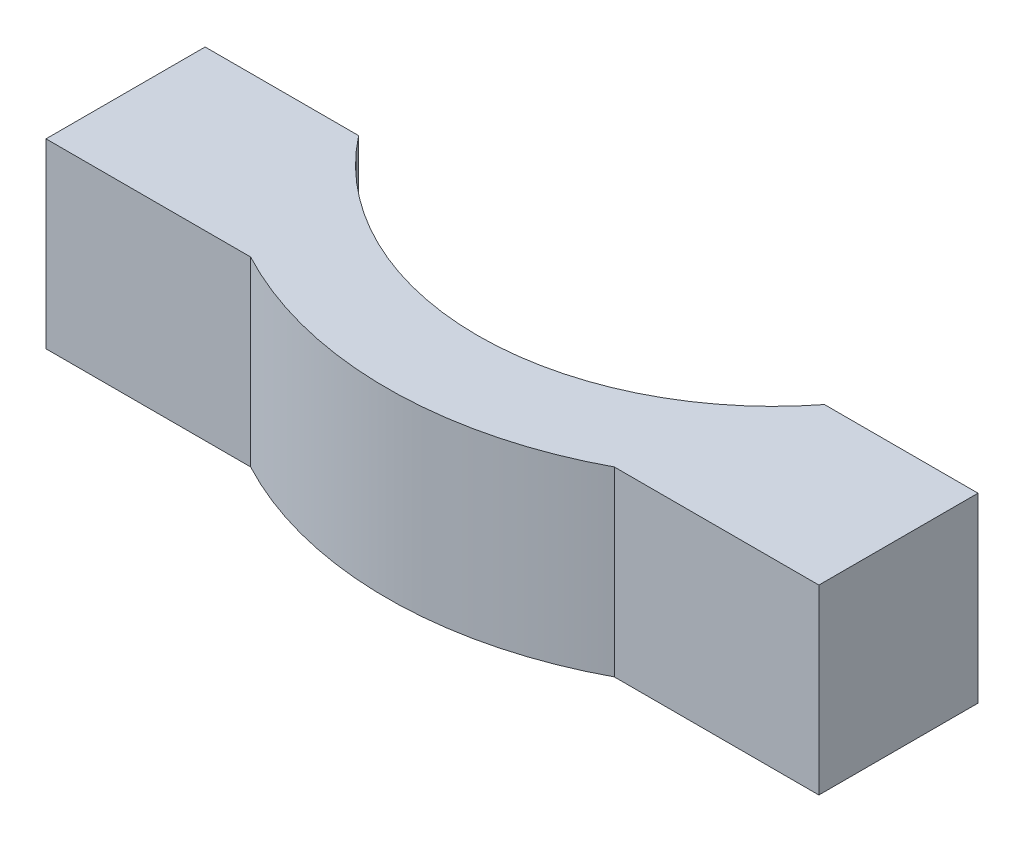
ISO-10303-21;
HEADER;
FILE_DESCRIPTION(('STEP AP214'),'2;1');
FILE_NAME('part.step','',(''),(''),'','','');
FILE_SCHEMA(('AUTOMOTIVE_DESIGN { 1 0 10303 214 1 1 1 1 }'));
ENDSEC;
DATA;
#1=APPLICATION_CONTEXT('core data for automotive mechanical design processes');
#2=APPLICATION_PROTOCOL_DEFINITION('international standard','automotive_design',2000,#1);
#3=PRODUCT_CONTEXT('',#1,'mechanical');
#4=PRODUCT('Part','Part','',(#3));
#5=PRODUCT_RELATED_PRODUCT_CATEGORY('part','',(#4));
#6=PRODUCT_DEFINITION_FORMATION('','',#4);
#7=PRODUCT_DEFINITION_CONTEXT('part definition',#1,'design');
#8=PRODUCT_DEFINITION('design','',#6,#7);
#9=PRODUCT_DEFINITION_SHAPE('','',#8);
#10=(LENGTH_UNIT() NAMED_UNIT(*) SI_UNIT(.MILLI.,.METRE.));
#11=(NAMED_UNIT(*) PLANE_ANGLE_UNIT() SI_UNIT($,.RADIAN.));
#12=(NAMED_UNIT(*) SI_UNIT($,.STERADIAN.) SOLID_ANGLE_UNIT());
#13=UNCERTAINTY_MEASURE_WITH_UNIT(LENGTH_MEASURE(1.E-05),#10,'distance_accuracy_value','');
#14=(GEOMETRIC_REPRESENTATION_CONTEXT(3) GLOBAL_UNCERTAINTY_ASSIGNED_CONTEXT((#13)) GLOBAL_UNIT_ASSIGNED_CONTEXT((#10,
#11,#12)) REPRESENTATION_CONTEXT('',''));
#15=CARTESIAN_POINT('',(0.,0.,0.));
#16=DIRECTION('',(0.,0.,1.));
#17=DIRECTION('',(1.,0.,0.));
#18=AXIS2_PLACEMENT_3D('',#15,#16,#17);
#19=CARTESIAN_POINT('',(0.,8.,0.));
#20=DIRECTION('',(0.,-1.,0.));
#21=DIRECTION('',(0.,0.,-1.));
#22=AXIS2_PLACEMENT_3D('',#19,#20,#21);
#23=CYLINDRICAL_SURFACE('',#22,17.);
#24=CARTESIAN_POINT('',(0.,8.,0.));
#25=DIRECTION('',(0.,1.,0.));
#26=DIRECTION('',(0.,0.,1.));
#27=AXIS2_PLACEMENT_3D('',#24,#25,#26);
#28=CIRCLE('',#27,17.);
#29=CARTESIAN_POINT('',(-7.99999999999978,8.,15.0000000000001));
#30=VERTEX_POINT('',#29);
#31=CARTESIAN_POINT('',(7.99999999999978,8.,15.0000000000001));
#32=VERTEX_POINT('',#31);
#33=EDGE_CURVE('E143',#30,#32,#28,.T.);
#34=ORIENTED_EDGE('',*,*,#33,.F.);
#35=DIRECTION('',(0.,-1.,0.));
#36=VECTOR('',#35,1.);
#37=CARTESIAN_POINT('',(-7.99999999999978,8.,15.0000000000001));
#38=LINE('',#37,#36);
#39=CARTESIAN_POINT('',(-7.99999999999978,0.,15.0000000000001));
#40=VERTEX_POINT('',#39);
#41=EDGE_CURVE('E139',#30,#40,#38,.T.);
#42=ORIENTED_EDGE('',*,*,#41,.T.);
#43=CARTESIAN_POINT('',(0.,0.,0.));
#44=DIRECTION('',(0.,1.,0.));
#45=DIRECTION('',(0.,0.,1.));
#46=AXIS2_PLACEMENT_3D('',#43,#44,#45);
#47=CIRCLE('',#46,17.);
#48=CARTESIAN_POINT('',(7.99999999999978,0.,15.0000000000001));
#49=VERTEX_POINT('',#48);
#50=EDGE_CURVE('E142',#40,#49,#47,.T.);
#51=ORIENTED_EDGE('',*,*,#50,.T.);
#52=DIRECTION('',(0.,-1.,0.));
#53=VECTOR('',#52,1.);
#54=CARTESIAN_POINT('',(7.99999999999978,8.,15.0000000000001));
#55=LINE('',#54,#53);
#56=EDGE_CURVE('E135',#49,#32,#55,.F.);
#57=ORIENTED_EDGE('',*,*,#56,.T.);
#58=EDGE_LOOP('',(#34,#42,#51,#57));
#59=FACE_BOUND('',#58,.T.);
#60=ADVANCED_FACE('F33',(#59),#23,.T.);
#61=CARTESIAN_POINT('',(0.,8.,0.));
#62=DIRECTION('',(0.,1.,0.));
#63=DIRECTION('',(0.,0.,1.));
#64=AXIS2_PLACEMENT_3D('',#61,#62,#63);
#65=PLANE('',#64);
#66=DIRECTION('',(1.,0.,0.));
#67=VECTOR('',#66,1.);
#68=CARTESIAN_POINT('',(-20.1033868877971,8.,8.));
#69=LINE('',#68,#67);
#70=CARTESIAN_POINT('',(-17.,8.,8.));
#71=VERTEX_POINT('',#70);
#72=CARTESIAN_POINT('',(-10.2469507659596,8.,8.));
#73=VERTEX_POINT('',#72);
#74=EDGE_CURVE('E47',#71,#73,#69,.T.);
#75=ORIENTED_EDGE('',*,*,#74,.F.);
#76=DIRECTION('',(0.,0.,1.));
#77=VECTOR('',#76,1.);
#78=CARTESIAN_POINT('',(-17.,8.,1.18710365520667E-13));
#79=LINE('',#78,#77);
#80=CARTESIAN_POINT('',(-17.,8.,15.0000000000001));
#81=VERTEX_POINT('',#80);
#82=EDGE_CURVE('E107',#71,#81,#79,.T.);
#83=ORIENTED_EDGE('',*,*,#82,.T.);
#84=DIRECTION('',(1.,0.,0.));
#85=VECTOR('',#84,1.);
#86=CARTESIAN_POINT('',(-17.,8.,15.0000000000001));
#87=LINE('',#86,#85);
#88=EDGE_CURVE('E120',#81,#30,#87,.T.);
#89=ORIENTED_EDGE('',*,*,#88,.T.);
#90=ORIENTED_EDGE('',*,*,#33,.T.);
#91=CARTESIAN_POINT('',(17.,8.,15.0000000000001));
#92=VERTEX_POINT('',#91);
#93=EDGE_CURVE('E117',#32,#92,#87,.T.);
#94=ORIENTED_EDGE('',*,*,#93,.T.);
#95=DIRECTION('',(0.,0.,-1.));
#96=VECTOR('',#95,1.);
#97=CARTESIAN_POINT('',(17.,8.,1.18710365520667E-13));
#98=LINE('',#97,#96);
#99=CARTESIAN_POINT('',(17.,8.,8.));
#100=VERTEX_POINT('',#99);
#101=EDGE_CURVE('E128',#92,#100,#98,.T.);
#102=ORIENTED_EDGE('',*,*,#101,.T.);
#103=CARTESIAN_POINT('',(10.2469507659596,8.,8.));
#104=VERTEX_POINT('',#103);
#105=EDGE_CURVE('E111',#104,#100,#69,.T.);
#106=ORIENTED_EDGE('',*,*,#105,.F.);
#107=CARTESIAN_POINT('',(0.,8.,0.));
#108=DIRECTION('',(0.,1.,0.));
#109=DIRECTION('',(0.,0.,1.));
#110=AXIS2_PLACEMENT_3D('',#107,#108,#109);
#111=CIRCLE('',#110,13.);
#112=EDGE_CURVE('E101',#73,#104,#111,.T.);
#113=ORIENTED_EDGE('',*,*,#112,.F.);
#114=EDGE_LOOP('',(#75,#83,#89,#90,#94,#102,#106,#113));
#115=FACE_BOUND('',#114,.T.);
#116=ADVANCED_FACE('F106',(#115),#65,.T.);
#117=CARTESIAN_POINT('',(0.,0.,0.));
#118=DIRECTION('',(0.,1.,0.));
#119=DIRECTION('',(0.,0.,1.));
#120=AXIS2_PLACEMENT_3D('',#117,#118,#119);
#121=PLANE('',#120);
#122=DIRECTION('',(0.,0.,1.));
#123=VECTOR('',#122,1.);
#124=CARTESIAN_POINT('',(-17.,0.,1.18710365520667E-13));
#125=LINE('',#124,#123);
#126=CARTESIAN_POINT('',(-17.,0.,8.));
#127=VERTEX_POINT('',#126);
#128=CARTESIAN_POINT('',(-17.,0.,15.0000000000001));
#129=VERTEX_POINT('',#128);
#130=EDGE_CURVE('E131',#127,#129,#125,.T.);
#131=ORIENTED_EDGE('',*,*,#130,.F.);
#132=DIRECTION('',(1.,0.,0.));
#133=VECTOR('',#132,1.);
#134=CARTESIAN_POINT('',(-20.1033868877971,0.,8.));
#135=LINE('',#134,#133);
#136=CARTESIAN_POINT('',(-10.2469507659596,0.,8.));
#137=VERTEX_POINT('',#136);
#138=EDGE_CURVE('E97',#127,#137,#135,.T.);
#139=ORIENTED_EDGE('',*,*,#138,.T.);
#140=CARTESIAN_POINT('',(0.,0.,0.));
#141=DIRECTION('',(0.,1.,0.));
#142=DIRECTION('',(0.,0.,1.));
#143=AXIS2_PLACEMENT_3D('',#140,#141,#142);
#144=CIRCLE('',#143,13.);
#145=CARTESIAN_POINT('',(10.2469507659596,0.,8.));
#146=VERTEX_POINT('',#145);
#147=EDGE_CURVE('E118',#137,#146,#144,.T.);
#148=ORIENTED_EDGE('',*,*,#147,.T.);
#149=CARTESIAN_POINT('',(17.,0.,8.));
#150=VERTEX_POINT('',#149);
#151=EDGE_CURVE('E55',#146,#150,#135,.T.);
#152=ORIENTED_EDGE('',*,*,#151,.T.);
#153=DIRECTION('',(0.,0.,-1.));
#154=VECTOR('',#153,1.);
#155=CARTESIAN_POINT('',(17.,0.,1.18710365520667E-13));
#156=LINE('',#155,#154);
#157=CARTESIAN_POINT('',(17.,0.,15.0000000000001));
#158=VERTEX_POINT('',#157);
#159=EDGE_CURVE('E125',#158,#150,#156,.T.);
#160=ORIENTED_EDGE('',*,*,#159,.F.);
#161=DIRECTION('',(1.,0.,0.));
#162=VECTOR('',#161,1.);
#163=CARTESIAN_POINT('',(-17.,0.,15.0000000000001));
#164=LINE('',#163,#162);
#165=EDGE_CURVE('E157',#49,#158,#164,.T.);
#166=ORIENTED_EDGE('',*,*,#165,.F.);
#167=ORIENTED_EDGE('',*,*,#50,.F.);
#168=EDGE_CURVE('E158',#129,#40,#164,.T.);
#169=ORIENTED_EDGE('',*,*,#168,.F.);
#170=EDGE_LOOP('',(#131,#139,#148,#152,#160,#166,#167,#169));
#171=FACE_BOUND('',#170,.T.);
#172=ADVANCED_FACE('F151',(#171),#121,.F.);
#173=CARTESIAN_POINT('',(-17.,0.,1.18710365520667E-13));
#174=DIRECTION('',(-1.,0.,0.));
#175=DIRECTION('',(0.,0.,1.));
#176=AXIS2_PLACEMENT_3D('',#173,#174,#175);
#177=PLANE('',#176);
#178=DIRECTION('',(0.,1.,0.));
#179=VECTOR('',#178,1.);
#180=CARTESIAN_POINT('',(-17.,0.,8.));
#181=LINE('',#180,#179);
#182=EDGE_CURVE('E94',#127,#71,#181,.T.);
#183=ORIENTED_EDGE('',*,*,#182,.F.);
#184=ORIENTED_EDGE('',*,*,#130,.T.);
#185=DIRECTION('',(0.,1.,0.));
#186=VECTOR('',#185,1.);
#187=CARTESIAN_POINT('',(-17.,0.,15.0000000000001));
#188=LINE('',#187,#186);
#189=EDGE_CURVE('E115',#129,#81,#188,.T.);
#190=ORIENTED_EDGE('',*,*,#189,.T.);
#191=ORIENTED_EDGE('',*,*,#82,.F.);
#192=EDGE_LOOP('',(#183,#184,#190,#191));
#193=FACE_BOUND('',#192,.T.);
#194=ADVANCED_FACE('F113',(#193),#177,.T.);
#195=CARTESIAN_POINT('',(-17.,0.,15.0000000000001));
#196=DIRECTION('',(0.,0.,1.));
#197=DIRECTION('',(1.,0.,0.));
#198=AXIS2_PLACEMENT_3D('',#195,#196,#197);
#199=PLANE('',#198);
#200=ORIENTED_EDGE('',*,*,#41,.F.);
#201=ORIENTED_EDGE('',*,*,#88,.F.);
#202=ORIENTED_EDGE('',*,*,#189,.F.);
#203=ORIENTED_EDGE('',*,*,#168,.T.);
#204=EDGE_LOOP('',(#200,#201,#202,#203));
#205=FACE_BOUND('',#204,.T.);
#206=ADVANCED_FACE('F174',(#205),#199,.T.);
#207=ORIENTED_EDGE('',*,*,#56,.F.);
#208=ORIENTED_EDGE('',*,*,#165,.T.);
#209=DIRECTION('',(0.,1.,0.));
#210=VECTOR('',#209,1.);
#211=CARTESIAN_POINT('',(17.,0.,15.0000000000001));
#212=LINE('',#211,#210);
#213=EDGE_CURVE('E132',#158,#92,#212,.T.);
#214=ORIENTED_EDGE('',*,*,#213,.T.);
#215=ORIENTED_EDGE('',*,*,#93,.F.);
#216=EDGE_LOOP('',(#207,#208,#214,#215));
#217=FACE_BOUND('',#216,.T.);
#218=ADVANCED_FACE('F165',(#217),#199,.T.);
#219=CARTESIAN_POINT('',(17.,0.,1.18710365520667E-13));
#220=DIRECTION('',(1.,0.,0.));
#221=DIRECTION('',(0.,0.,-1.));
#222=AXIS2_PLACEMENT_3D('',#219,#220,#221);
#223=PLANE('',#222);
#224=DIRECTION('',(0.,-1.,0.));
#225=VECTOR('',#224,1.);
#226=CARTESIAN_POINT('',(17.,0.,8.));
#227=LINE('',#226,#225);
#228=EDGE_CURVE('E102',#100,#150,#227,.T.);
#229=ORIENTED_EDGE('',*,*,#228,.F.);
#230=ORIENTED_EDGE('',*,*,#101,.F.);
#231=ORIENTED_EDGE('',*,*,#213,.F.);
#232=ORIENTED_EDGE('',*,*,#159,.T.);
#233=EDGE_LOOP('',(#229,#230,#231,#232));
#234=FACE_BOUND('',#233,.T.);
#235=ADVANCED_FACE('F171',(#234),#223,.T.);
#236=CARTESIAN_POINT('',(0.,0.,0.));
#237=DIRECTION('',(0.,1.,0.));
#238=DIRECTION('',(0.,0.,1.));
#239=AXIS2_PLACEMENT_3D('',#236,#237,#238);
#240=CYLINDRICAL_SURFACE('',#239,13.);
#241=ORIENTED_EDGE('',*,*,#112,.T.);
#242=DIRECTION('',(0.,1.,0.));
#243=VECTOR('',#242,1.);
#244=CARTESIAN_POINT('',(10.2469507659596,0.,8.));
#245=LINE('',#244,#243);
#246=EDGE_CURVE('E11',#104,#146,#245,.F.);
#247=ORIENTED_EDGE('',*,*,#246,.T.);
#248=ORIENTED_EDGE('',*,*,#147,.F.);
#249=DIRECTION('',(0.,1.,0.));
#250=VECTOR('',#249,1.);
#251=CARTESIAN_POINT('',(-10.2469507659596,0.,8.));
#252=LINE('',#251,#250);
#253=EDGE_CURVE('E40',#137,#73,#252,.T.);
#254=ORIENTED_EDGE('',*,*,#253,.T.);
#255=EDGE_LOOP('',(#241,#247,#248,#254));
#256=FACE_BOUND('',#255,.T.);
#257=ADVANCED_FACE('F149',(#256),#240,.F.);
#258=CARTESIAN_POINT('',(-20.1033868877971,0.,8.));
#259=DIRECTION('',(0.,0.,1.));
#260=DIRECTION('',(1.,0.,0.));
#261=AXIS2_PLACEMENT_3D('',#258,#259,#260);
#262=PLANE('',#261);
#263=ORIENTED_EDGE('',*,*,#182,.T.);
#264=ORIENTED_EDGE('',*,*,#74,.T.);
#265=ORIENTED_EDGE('',*,*,#253,.F.);
#266=ORIENTED_EDGE('',*,*,#138,.F.);
#267=EDGE_LOOP('',(#263,#264,#265,#266));
#268=FACE_BOUND('',#267,.T.);
#269=ADVANCED_FACE('F95',(#268),#262,.F.);
#270=ORIENTED_EDGE('',*,*,#228,.T.);
#271=ORIENTED_EDGE('',*,*,#151,.F.);
#272=ORIENTED_EDGE('',*,*,#246,.F.);
#273=ORIENTED_EDGE('',*,*,#105,.T.);
#274=EDGE_LOOP('',(#270,#271,#272,#273));
#275=FACE_BOUND('',#274,.T.);
#276=ADVANCED_FACE('F223',(#275),#262,.F.);
#277=CLOSED_SHELL('',(#60,#116,#172,#194,#206,#218,#235,#257,#269,#276));
#278=MANIFOLD_SOLID_BREP('B2',#277);
#279=ADVANCED_BREP_SHAPE_REPRESENTATION('',(#18,#278),#14);
#280=SHAPE_DEFINITION_REPRESENTATION(#9,#279);
ENDSEC;
END-ISO-10303-21;
